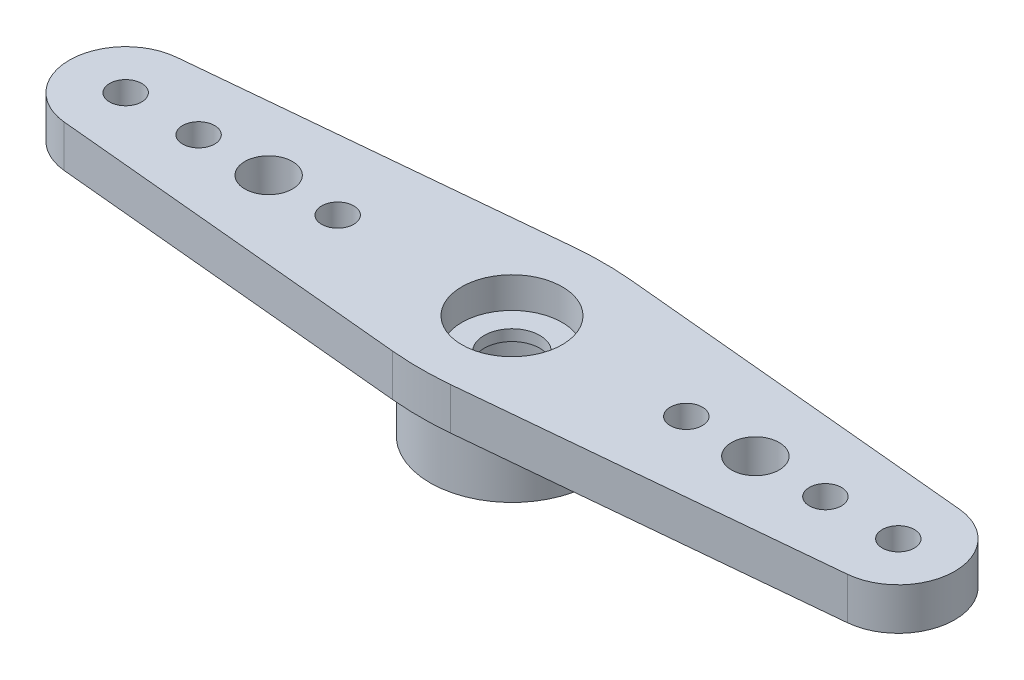
ISO-10303-21;
HEADER;
FILE_DESCRIPTION(('STEP AP214'),'2;1');
FILE_NAME('part.step','',(''),(''),'','','');
FILE_SCHEMA(('AUTOMOTIVE_DESIGN { 1 0 10303 214 1 1 1 1 }'));
ENDSEC;
DATA;
#1=APPLICATION_CONTEXT('core data for automotive mechanical design processes');
#2=APPLICATION_PROTOCOL_DEFINITION('international standard','automotive_design',2000,#1);
#3=PRODUCT_CONTEXT('',#1,'mechanical');
#4=PRODUCT('Part','Part','',(#3));
#5=PRODUCT_RELATED_PRODUCT_CATEGORY('part','',(#4));
#6=PRODUCT_DEFINITION_FORMATION('','',#4);
#7=PRODUCT_DEFINITION_CONTEXT('part definition',#1,'design');
#8=PRODUCT_DEFINITION('design','',#6,#7);
#9=PRODUCT_DEFINITION_SHAPE('','',#8);
#10=(LENGTH_UNIT() NAMED_UNIT(*) SI_UNIT(.MILLI.,.METRE.));
#11=(NAMED_UNIT(*) PLANE_ANGLE_UNIT() SI_UNIT($,.RADIAN.));
#12=(NAMED_UNIT(*) SI_UNIT($,.STERADIAN.) SOLID_ANGLE_UNIT());
#13=UNCERTAINTY_MEASURE_WITH_UNIT(LENGTH_MEASURE(1.E-05),#10,'distance_accuracy_value','');
#14=(GEOMETRIC_REPRESENTATION_CONTEXT(3) GLOBAL_UNCERTAINTY_ASSIGNED_CONTEXT((#13)) GLOBAL_UNIT_ASSIGNED_CONTEXT((#10,
#11,#12)) REPRESENTATION_CONTEXT('',''));
#15=CARTESIAN_POINT('',(0.,0.,0.));
#16=DIRECTION('',(0.,0.,1.));
#17=DIRECTION('',(1.,0.,0.));
#18=AXIS2_PLACEMENT_3D('',#15,#16,#17);
#19=CARTESIAN_POINT('',(0.,4.2672,0.));
#20=DIRECTION('',(0.,-1.,0.));
#21=DIRECTION('',(0.,0.,-1.));
#22=AXIS2_PLACEMENT_3D('',#19,#20,#21);
#23=CYLINDRICAL_SURFACE('',#22,1.143);
#24=CARTESIAN_POINT('',(0.,2.54,0.));
#25=DIRECTION('',(0.,1.,0.));
#26=DIRECTION('',(0.,0.,1.));
#27=AXIS2_PLACEMENT_3D('',#24,#25,#26);
#28=CIRCLE('',#27,1.143);
#29=CARTESIAN_POINT('',(0.,2.54,1.143));
#30=VERTEX_POINT('',#29);
#31=EDGE_CURVE('E117',#30,#30,#28,.T.);
#32=ORIENTED_EDGE('',*,*,#31,.F.);
#33=EDGE_LOOP('',(#32));
#34=FACE_BOUND('',#33,.T.);
#35=CARTESIAN_POINT('',(0.,2.9972,0.));
#36=DIRECTION('',(0.,1.,0.));
#37=DIRECTION('',(0.,0.,1.));
#38=AXIS2_PLACEMENT_3D('',#35,#36,#37);
#39=CIRCLE('',#38,1.143);
#40=CARTESIAN_POINT('',(0.,2.9972,1.143));
#41=VERTEX_POINT('',#40);
#42=EDGE_CURVE('E405',#41,#41,#39,.F.);
#43=ORIENTED_EDGE('',*,*,#42,.F.);
#44=EDGE_LOOP('',(#43));
#45=FACE_BOUND('',#44,.T.);
#46=ADVANCED_FACE('F40',(#34,#45),#23,.F.);
#47=CARTESIAN_POINT('',(0.,0.,0.));
#48=DIRECTION('',(0.,1.,0.));
#49=DIRECTION('',(0.,0.,1.));
#50=AXIS2_PLACEMENT_3D('',#47,#48,#49);
#51=PLANE('',#50);
#52=CARTESIAN_POINT('',(0.,0.,0.));
#53=DIRECTION('',(0.,1.,0.));
#54=DIRECTION('',(0.,0.,1.));
#55=AXIS2_PLACEMENT_3D('',#52,#53,#54);
#56=CIRCLE('',#55,3.3655);
#57=CARTESIAN_POINT('',(0.,0.,3.3655));
#58=VERTEX_POINT('',#57);
#59=EDGE_CURVE('E238',#58,#58,#56,.T.);
#60=ORIENTED_EDGE('',*,*,#59,.F.);
#61=EDGE_LOOP('',(#60));
#62=FACE_BOUND('',#61,.T.);
#63=CARTESIAN_POINT('',(0.,0.,0.));
#64=DIRECTION('',(0.,1.,0.));
#65=DIRECTION('',(0.,0.,1.));
#66=AXIS2_PLACEMENT_3D('',#63,#64,#65);
#67=CIRCLE('',#66,2.2352);
#68=CARTESIAN_POINT('',(0.,0.,2.2352));
#69=VERTEX_POINT('',#68);
#70=EDGE_CURVE('E234',#69,#69,#67,.T.);
#71=ORIENTED_EDGE('',*,*,#70,.T.);
#72=EDGE_LOOP('',(#71));
#73=FACE_BOUND('',#72,.T.);
#74=ADVANCED_FACE('F294',(#62,#73),#51,.F.);
#75=CARTESIAN_POINT('',(0.,2.54,0.));
#76=DIRECTION('',(0.,-1.,0.));
#77=DIRECTION('',(0.,0.,-1.));
#78=AXIS2_PLACEMENT_3D('',#75,#76,#77);
#79=CYLINDRICAL_SURFACE('',#78,3.3655);
#80=CARTESIAN_POINT('',(0.,2.54,0.));
#81=DIRECTION('',(0.,1.,0.));
#82=DIRECTION('',(0.,0.,1.));
#83=AXIS2_PLACEMENT_3D('',#80,#81,#82);
#84=CIRCLE('',#83,3.3655);
#85=CARTESIAN_POINT('',(0.,2.54,3.3655));
#86=VERTEX_POINT('',#85);
#87=EDGE_CURVE('E239',#86,#86,#84,.T.);
#88=ORIENTED_EDGE('',*,*,#87,.F.);
#89=EDGE_LOOP('',(#88));
#90=FACE_BOUND('',#89,.T.);
#91=ORIENTED_EDGE('',*,*,#59,.T.);
#92=EDGE_LOOP('',(#91));
#93=FACE_BOUND('',#92,.T.);
#94=ADVANCED_FACE('F300',(#90,#93),#79,.T.);
#95=CARTESIAN_POINT('',(0.,2.54,0.));
#96=DIRECTION('',(0.,-1.,0.));
#97=DIRECTION('',(0.,0.,-1.));
#98=AXIS2_PLACEMENT_3D('',#95,#96,#97);
#99=CYLINDRICAL_SURFACE('',#98,2.2352);
#100=CARTESIAN_POINT('',(0.,2.54,0.));
#101=DIRECTION('',(0.,1.,0.));
#102=DIRECTION('',(0.,0.,1.));
#103=AXIS2_PLACEMENT_3D('',#100,#101,#102);
#104=CIRCLE('',#103,2.2352);
#105=CARTESIAN_POINT('',(0.,2.54,2.2352));
#106=VERTEX_POINT('',#105);
#107=EDGE_CURVE('E128',#106,#106,#104,.T.);
#108=ORIENTED_EDGE('',*,*,#107,.T.);
#109=EDGE_LOOP('',(#108));
#110=FACE_BOUND('',#109,.T.);
#111=ORIENTED_EDGE('',*,*,#70,.F.);
#112=EDGE_LOOP('',(#111));
#113=FACE_BOUND('',#112,.T.);
#114=ADVANCED_FACE('F345',(#110,#113),#99,.F.);
#115=CARTESIAN_POINT('',(-29.0607200096115,2.54,0.));
#116=DIRECTION('',(0.,1.,0.));
#117=DIRECTION('',(0.,0.,1.));
#118=AXIS2_PLACEMENT_3D('',#115,#116,#117);
#119=PLANE('',#118);
#120=CARTESIAN_POINT('',(10.,2.54,0.));
#121=DIRECTION('',(0.,1.,0.));
#122=DIRECTION('',(0.,0.,1.));
#123=AXIS2_PLACEMENT_3D('',#120,#121,#122);
#124=CIRCLE('',#123,0.98);
#125=CARTESIAN_POINT('',(10.,2.54,0.98));
#126=VERTEX_POINT('',#125);
#127=EDGE_CURVE('E397',#126,#126,#124,.T.);
#128=ORIENTED_EDGE('',*,*,#127,.T.);
#129=EDGE_LOOP('',(#128));
#130=FACE_BOUND('',#129,.T.);
#131=CARTESIAN_POINT('',(-10.,2.54,0.));
#132=DIRECTION('',(0.,1.,0.));
#133=DIRECTION('',(0.,0.,1.));
#134=AXIS2_PLACEMENT_3D('',#131,#132,#133);
#135=CIRCLE('',#134,0.98);
#136=CARTESIAN_POINT('',(-10.,2.54,0.98));
#137=VERTEX_POINT('',#136);
#138=EDGE_CURVE('E400',#137,#137,#135,.T.);
#139=ORIENTED_EDGE('',*,*,#138,.T.);
#140=EDGE_LOOP('',(#139));
#141=FACE_BOUND('',#140,.T.);
#142=DIRECTION('',(-0.995596740434201,0.,0.0937396950965555));
#143=VECTOR('',#142,1.);
#144=CARTESIAN_POINT('',(-29.162120546294,2.54,-1.07696151236052));
#145=LINE('',#144,#143);
#146=CARTESIAN_POINT('',(-1.19049412772623,2.54,-3.71060988156648));
#147=VERTEX_POINT('',#146);
#148=CARTESIAN_POINT('',(-16.09226517831,2.54,-2.30754434514137));
#149=VERTEX_POINT('',#148);
#150=EDGE_CURVE('E123',#147,#149,#145,.T.);
#151=ORIENTED_EDGE('',*,*,#150,.F.);
#152=CARTESIAN_POINT('',(0.,2.54,8.93346872194787));
#153=DIRECTION('',(0.,1.,0.));
#154=DIRECTION('',(0.,0.,1.));
#155=AXIS2_PLACEMENT_3D('',#152,#153,#154);
#156=CIRCLE('',#155,12.7);
#157=CARTESIAN_POINT('',(1.19049412772628,2.54,-3.71060988156648));
#158=VERTEX_POINT('',#157);
#159=EDGE_CURVE('E252',#147,#158,#156,.F.);
#160=ORIENTED_EDGE('',*,*,#159,.T.);
#161=DIRECTION('',(0.995596740434201,0.,0.0937396950965555));
#162=VECTOR('',#161,1.);
#163=CARTESIAN_POINT('',(-28.4485987983057,2.54,-6.50125736059801));
#164=LINE('',#163,#162);
#165=CARTESIAN_POINT('',(16.09226517831,2.54,-2.30754434514137));
#166=VERTEX_POINT('',#165);
#167=EDGE_CURVE('E192',#158,#166,#164,.T.);
#168=ORIENTED_EDGE('',*,*,#167,.T.);
#169=CARTESIAN_POINT('',(15.875,2.54,0.));
#170=DIRECTION('',(0.,1.,0.));
#171=DIRECTION('',(0.,0.,1.));
#172=AXIS2_PLACEMENT_3D('',#169,#170,#171);
#173=CIRCLE('',#172,2.31775);
#174=CARTESIAN_POINT('',(16.09226517831,2.54,2.30754434514137));
#175=VERTEX_POINT('',#174);
#176=EDGE_CURVE('E188',#175,#166,#173,.T.);
#177=ORIENTED_EDGE('',*,*,#176,.F.);
#178=DIRECTION('',(0.995596740434201,0.,-0.0937396950965555));
#179=VECTOR('',#178,1.);
#180=CARTESIAN_POINT('',(-28.4485987983057,2.54,6.50125736059801));
#181=LINE('',#180,#179);
#182=CARTESIAN_POINT('',(1.19049412772627,2.54,3.71060988156648));
#183=VERTEX_POINT('',#182);
#184=EDGE_CURVE('E185',#183,#175,#181,.T.);
#185=ORIENTED_EDGE('',*,*,#184,.F.);
#186=CARTESIAN_POINT('',(0.,2.54,-8.93346872194787));
#187=DIRECTION('',(0.,1.,0.));
#188=DIRECTION('',(0.,0.,1.));
#189=AXIS2_PLACEMENT_3D('',#186,#187,#188);
#190=CIRCLE('',#189,12.7);
#191=CARTESIAN_POINT('',(-1.19049412772624,2.54,3.71060988156648));
#192=VERTEX_POINT('',#191);
#193=EDGE_CURVE('E249',#183,#192,#190,.F.);
#194=ORIENTED_EDGE('',*,*,#193,.T.);
#195=DIRECTION('',(-0.995596740434201,0.,-0.0937396950965555));
#196=VECTOR('',#195,1.);
#197=CARTESIAN_POINT('',(-29.162120546294,2.54,1.07696151236052));
#198=LINE('',#197,#196);
#199=CARTESIAN_POINT('',(-16.09226517831,2.54,2.30754434514137));
#200=VERTEX_POINT('',#199);
#201=EDGE_CURVE('E182',#192,#200,#198,.T.);
#202=ORIENTED_EDGE('',*,*,#201,.T.);
#203=CARTESIAN_POINT('',(-15.875,2.54,0.));
#204=DIRECTION('',(0.,1.,0.));
#205=DIRECTION('',(0.,0.,1.));
#206=AXIS2_PLACEMENT_3D('',#203,#204,#205);
#207=CIRCLE('',#206,2.31775);
#208=EDGE_CURVE('E178',#200,#149,#207,.F.);
#209=ORIENTED_EDGE('',*,*,#208,.T.);
#210=EDGE_LOOP('',(#151,#160,#168,#177,#185,#194,#202,#209));
#211=FACE_BOUND('',#210,.T.);
#212=CARTESIAN_POINT('',(-7.1628,2.54,0.));
#213=DIRECTION('',(0.,1.,0.));
#214=DIRECTION('',(0.,0.,1.));
#215=AXIS2_PLACEMENT_3D('',#212,#213,#214);
#216=CIRCLE('',#215,0.6604);
#217=CARTESIAN_POINT('',(-7.1628,2.54,0.6604));
#218=VERTEX_POINT('',#217);
#219=EDGE_CURVE('E195',#218,#218,#216,.F.);
#220=ORIENTED_EDGE('',*,*,#219,.F.);
#221=EDGE_LOOP('',(#220));
#222=FACE_BOUND('',#221,.T.);
#223=CARTESIAN_POINT('',(-12.8778,2.54,0.));
#224=DIRECTION('',(0.,1.,0.));
#225=DIRECTION('',(0.,0.,1.));
#226=AXIS2_PLACEMENT_3D('',#223,#224,#225);
#227=CIRCLE('',#226,0.660399999999998);
#228=CARTESIAN_POINT('',(-12.8778,2.54,0.660399999999998));
#229=VERTEX_POINT('',#228);
#230=EDGE_CURVE('E199',#229,#229,#227,.F.);
#231=ORIENTED_EDGE('',*,*,#230,.F.);
#232=EDGE_LOOP('',(#231));
#233=FACE_BOUND('',#232,.T.);
#234=CARTESIAN_POINT('',(-15.875,2.54,0.));
#235=DIRECTION('',(0.,1.,0.));
#236=DIRECTION('',(0.,0.,1.));
#237=AXIS2_PLACEMENT_3D('',#234,#235,#236);
#238=CIRCLE('',#237,0.660399999999998);
#239=CARTESIAN_POINT('',(-15.875,2.54,0.660399999999998));
#240=VERTEX_POINT('',#239);
#241=EDGE_CURVE('E203',#240,#240,#238,.F.);
#242=ORIENTED_EDGE('',*,*,#241,.F.);
#243=EDGE_LOOP('',(#242));
#244=FACE_BOUND('',#243,.T.);
#245=CARTESIAN_POINT('',(12.8778,2.54,0.));
#246=DIRECTION('',(0.,1.,0.));
#247=DIRECTION('',(0.,0.,1.));
#248=AXIS2_PLACEMENT_3D('',#245,#246,#247);
#249=CIRCLE('',#248,0.660399999999998);
#250=CARTESIAN_POINT('',(12.8778,2.54,0.660399999999998));
#251=VERTEX_POINT('',#250);
#252=EDGE_CURVE('E207',#251,#251,#249,.T.);
#253=ORIENTED_EDGE('',*,*,#252,.T.);
#254=EDGE_LOOP('',(#253));
#255=FACE_BOUND('',#254,.T.);
#256=CARTESIAN_POINT('',(7.1628,2.54,0.));
#257=DIRECTION('',(0.,1.,0.));
#258=DIRECTION('',(0.,0.,1.));
#259=AXIS2_PLACEMENT_3D('',#256,#257,#258);
#260=CIRCLE('',#259,0.6604);
#261=CARTESIAN_POINT('',(7.1628,2.54,0.6604));
#262=VERTEX_POINT('',#261);
#263=EDGE_CURVE('E211',#262,#262,#260,.T.);
#264=ORIENTED_EDGE('',*,*,#263,.T.);
#265=EDGE_LOOP('',(#264));
#266=FACE_BOUND('',#265,.T.);
#267=CARTESIAN_POINT('',(15.875,2.54,0.));
#268=DIRECTION('',(0.,1.,0.));
#269=DIRECTION('',(0.,0.,1.));
#270=AXIS2_PLACEMENT_3D('',#267,#268,#269);
#271=CIRCLE('',#270,0.660399999999998);
#272=CARTESIAN_POINT('',(15.875,2.54,0.660399999999998));
#273=VERTEX_POINT('',#272);
#274=EDGE_CURVE('E215',#273,#273,#271,.T.);
#275=ORIENTED_EDGE('',*,*,#274,.T.);
#276=EDGE_LOOP('',(#275));
#277=FACE_BOUND('',#276,.T.);
#278=ORIENTED_EDGE('',*,*,#87,.T.);
#279=EDGE_LOOP('',(#278));
#280=FACE_BOUND('',#279,.T.);
#281=ADVANCED_FACE('F271',(#130,#141,#211,#222,#233,#244,#255,#266,#277,#280),#119,.F.);
#282=CARTESIAN_POINT('',(-29.162120546294,4.2672,-1.07696151236052));
#283=DIRECTION('',(0.0937396950965555,0.,0.995596740434201));
#284=DIRECTION('',(0.995596740434201,0.,-0.0937396950965555));
#285=AXIS2_PLACEMENT_3D('',#282,#283,#284);
#286=PLANE('',#285);
#287=DIRECTION('',(-0.995596740434201,0.,0.0937396950965555));
#288=VECTOR('',#287,1.);
#289=CARTESIAN_POINT('',(-29.162120546294,4.2672,-1.07696151236052));
#290=LINE('',#289,#288);
#291=CARTESIAN_POINT('',(-1.19049412772623,4.2672,-3.71060988156648));
#292=VERTEX_POINT('',#291);
#293=CARTESIAN_POINT('',(-16.09226517831,4.2672,-2.30754434514137));
#294=VERTEX_POINT('',#293);
#295=EDGE_CURVE('E104',#292,#294,#290,.T.);
#296=ORIENTED_EDGE('',*,*,#295,.F.);
#297=DIRECTION('',(0.,-1.,0.));
#298=VECTOR('',#297,1.);
#299=CARTESIAN_POINT('',(-1.19049412772624,2.54,-3.71060988156648));
#300=LINE('',#299,#298);
#301=EDGE_CURVE('E243',#292,#147,#300,.T.);
#302=ORIENTED_EDGE('',*,*,#301,.T.);
#303=ORIENTED_EDGE('',*,*,#150,.T.);
#304=DIRECTION('',(0.,-1.,0.));
#305=VECTOR('',#304,1.);
#306=CARTESIAN_POINT('',(-16.09226517831,4.2672,-2.30754434514137));
#307=LINE('',#306,#305);
#308=EDGE_CURVE('E120',#294,#149,#307,.T.);
#309=ORIENTED_EDGE('',*,*,#308,.F.);
#310=EDGE_LOOP('',(#296,#302,#303,#309));
#311=FACE_BOUND('',#310,.T.);
#312=ADVANCED_FACE('F121',(#311),#286,.F.);
#313=CARTESIAN_POINT('',(-15.875,4.2672,0.));
#314=DIRECTION('',(0.,-1.,0.));
#315=DIRECTION('',(0.,0.,-1.));
#316=AXIS2_PLACEMENT_3D('',#313,#314,#315);
#317=CYLINDRICAL_SURFACE('',#316,2.31775);
#318=ORIENTED_EDGE('',*,*,#208,.F.);
#319=DIRECTION('',(0.,-1.,0.));
#320=VECTOR('',#319,1.);
#321=CARTESIAN_POINT('',(-16.09226517831,4.2672,2.30754434514137));
#322=LINE('',#321,#320);
#323=CARTESIAN_POINT('',(-16.09226517831,4.2672,2.30754434514137));
#324=VERTEX_POINT('',#323);
#325=EDGE_CURVE('E129',#324,#200,#322,.T.);
#326=ORIENTED_EDGE('',*,*,#325,.F.);
#327=CARTESIAN_POINT('',(-15.875,4.2672,0.));
#328=DIRECTION('',(0.,1.,0.));
#329=DIRECTION('',(0.,0.,1.));
#330=AXIS2_PLACEMENT_3D('',#327,#328,#329);
#331=CIRCLE('',#330,2.31775);
#332=EDGE_CURVE('E110',#324,#294,#331,.F.);
#333=ORIENTED_EDGE('',*,*,#332,.T.);
#334=ORIENTED_EDGE('',*,*,#308,.T.);
#335=EDGE_LOOP('',(#318,#326,#333,#334));
#336=FACE_BOUND('',#335,.T.);
#337=ADVANCED_FACE('F132',(#336),#317,.T.);
#338=CARTESIAN_POINT('',(-29.162120546294,4.2672,1.07696151236052));
#339=DIRECTION('',(-0.0937396950965555,0.,0.995596740434201));
#340=DIRECTION('',(0.995596740434201,0.,0.0937396950965555));
#341=AXIS2_PLACEMENT_3D('',#338,#339,#340);
#342=PLANE('',#341);
#343=ORIENTED_EDGE('',*,*,#201,.F.);
#344=DIRECTION('',(0.,-1.,0.));
#345=VECTOR('',#344,1.);
#346=CARTESIAN_POINT('',(-1.19049412772625,4.2672,3.71060988156648));
#347=LINE('',#346,#345);
#348=CARTESIAN_POINT('',(-1.19049412772624,4.2672,3.71060988156648));
#349=VERTEX_POINT('',#348);
#350=EDGE_CURVE('E11',#192,#349,#347,.F.);
#351=ORIENTED_EDGE('',*,*,#350,.T.);
#352=DIRECTION('',(-0.995596740434201,0.,-0.0937396950965555));
#353=VECTOR('',#352,1.);
#354=CARTESIAN_POINT('',(-29.162120546294,4.2672,1.07696151236052));
#355=LINE('',#354,#353);
#356=EDGE_CURVE('E135',#349,#324,#355,.T.);
#357=ORIENTED_EDGE('',*,*,#356,.T.);
#358=ORIENTED_EDGE('',*,*,#325,.T.);
#359=EDGE_LOOP('',(#343,#351,#357,#358));
#360=FACE_BOUND('',#359,.T.);
#361=ADVANCED_FACE('F282',(#360),#342,.T.);
#362=CARTESIAN_POINT('',(-28.4485987983057,4.2672,6.50125736059801));
#363=DIRECTION('',(-0.0937396950965555,0.,-0.995596740434201));
#364=DIRECTION('',(-0.995596740434201,0.,0.0937396950965555));
#365=AXIS2_PLACEMENT_3D('',#362,#363,#364);
#366=PLANE('',#365);
#367=DIRECTION('',(0.995596740434201,0.,-0.0937396950965555));
#368=VECTOR('',#367,1.);
#369=CARTESIAN_POINT('',(-28.4485987983057,4.2672,6.50125736059801));
#370=LINE('',#369,#368);
#371=CARTESIAN_POINT('',(1.19049412772627,4.2672,3.71060988156648));
#372=VERTEX_POINT('',#371);
#373=CARTESIAN_POINT('',(16.09226517831,4.2672,2.30754434514137));
#374=VERTEX_POINT('',#373);
#375=EDGE_CURVE('E138',#372,#374,#370,.T.);
#376=ORIENTED_EDGE('',*,*,#375,.F.);
#377=DIRECTION('',(0.,-1.,0.));
#378=VECTOR('',#377,1.);
#379=CARTESIAN_POINT('',(1.19049412772626,2.54,3.71060988156648));
#380=LINE('',#379,#378);
#381=EDGE_CURVE('E49',#372,#183,#380,.T.);
#382=ORIENTED_EDGE('',*,*,#381,.T.);
#383=ORIENTED_EDGE('',*,*,#184,.T.);
#384=DIRECTION('',(0.,-1.,0.));
#385=VECTOR('',#384,1.);
#386=CARTESIAN_POINT('',(16.09226517831,4.2672,2.30754434514137));
#387=LINE('',#386,#385);
#388=EDGE_CURVE('E225',#374,#175,#387,.T.);
#389=ORIENTED_EDGE('',*,*,#388,.F.);
#390=EDGE_LOOP('',(#376,#382,#383,#389));
#391=FACE_BOUND('',#390,.T.);
#392=ADVANCED_FACE('F266',(#391),#366,.F.);
#393=CARTESIAN_POINT('',(15.875,4.2672,0.));
#394=DIRECTION('',(0.,-1.,0.));
#395=DIRECTION('',(0.,0.,-1.));
#396=AXIS2_PLACEMENT_3D('',#393,#394,#395);
#397=CYLINDRICAL_SURFACE('',#396,2.31775);
#398=ORIENTED_EDGE('',*,*,#176,.T.);
#399=DIRECTION('',(0.,-1.,0.));
#400=VECTOR('',#399,1.);
#401=CARTESIAN_POINT('',(16.09226517831,4.2672,-2.30754434514137));
#402=LINE('',#401,#400);
#403=CARTESIAN_POINT('',(16.09226517831,4.2672,-2.30754434514137));
#404=VERTEX_POINT('',#403);
#405=EDGE_CURVE('E175',#404,#166,#402,.T.);
#406=ORIENTED_EDGE('',*,*,#405,.F.);
#407=CARTESIAN_POINT('',(15.875,4.2672,0.));
#408=DIRECTION('',(0.,1.,0.));
#409=DIRECTION('',(0.,0.,1.));
#410=AXIS2_PLACEMENT_3D('',#407,#408,#409);
#411=CIRCLE('',#410,2.31775);
#412=EDGE_CURVE('E144',#374,#404,#411,.T.);
#413=ORIENTED_EDGE('',*,*,#412,.F.);
#414=ORIENTED_EDGE('',*,*,#388,.T.);
#415=EDGE_LOOP('',(#398,#406,#413,#414));
#416=FACE_BOUND('',#415,.T.);
#417=ADVANCED_FACE('F276',(#416),#397,.T.);
#418=CARTESIAN_POINT('',(15.875,4.2672,0.));
#419=DIRECTION('',(0.,-1.,0.));
#420=DIRECTION('',(0.,0.,-1.));
#421=AXIS2_PLACEMENT_3D('',#418,#419,#420);
#422=CYLINDRICAL_SURFACE('',#421,0.660399999999998);
#423=CARTESIAN_POINT('',(15.875,4.2672,0.));
#424=DIRECTION('',(0.,1.,0.));
#425=DIRECTION('',(0.,0.,1.));
#426=AXIS2_PLACEMENT_3D('',#423,#424,#425);
#427=CIRCLE('',#426,0.660399999999998);
#428=CARTESIAN_POINT('',(15.875,4.2672,0.660399999999998));
#429=VERTEX_POINT('',#428);
#430=EDGE_CURVE('E171',#429,#429,#427,.T.);
#431=ORIENTED_EDGE('',*,*,#430,.T.);
#432=EDGE_LOOP('',(#431));
#433=FACE_BOUND('',#432,.T.);
#434=ORIENTED_EDGE('',*,*,#274,.F.);
#435=EDGE_LOOP('',(#434));
#436=FACE_BOUND('',#435,.T.);
#437=ADVANCED_FACE('F308',(#433,#436),#422,.F.);
#438=CARTESIAN_POINT('',(7.1628,4.2672,0.));
#439=DIRECTION('',(0.,-1.,0.));
#440=DIRECTION('',(0.,0.,-1.));
#441=AXIS2_PLACEMENT_3D('',#438,#439,#440);
#442=CYLINDRICAL_SURFACE('',#441,0.6604);
#443=CARTESIAN_POINT('',(7.1628,4.2672,0.));
#444=DIRECTION('',(0.,1.,0.));
#445=DIRECTION('',(0.,0.,1.));
#446=AXIS2_PLACEMENT_3D('',#443,#444,#445);
#447=CIRCLE('',#446,0.6604);
#448=CARTESIAN_POINT('',(7.1628,4.2672,0.6604));
#449=VERTEX_POINT('',#448);
#450=EDGE_CURVE('E167',#449,#449,#447,.T.);
#451=ORIENTED_EDGE('',*,*,#450,.T.);
#452=EDGE_LOOP('',(#451));
#453=FACE_BOUND('',#452,.T.);
#454=ORIENTED_EDGE('',*,*,#263,.F.);
#455=EDGE_LOOP('',(#454));
#456=FACE_BOUND('',#455,.T.);
#457=ADVANCED_FACE('F311',(#453,#456),#442,.F.);
#458=CARTESIAN_POINT('',(12.8778,4.2672,0.));
#459=DIRECTION('',(0.,-1.,0.));
#460=DIRECTION('',(0.,0.,-1.));
#461=AXIS2_PLACEMENT_3D('',#458,#459,#460);
#462=CYLINDRICAL_SURFACE('',#461,0.660399999999998);
#463=CARTESIAN_POINT('',(12.8778,4.2672,0.));
#464=DIRECTION('',(0.,1.,0.));
#465=DIRECTION('',(0.,0.,1.));
#466=AXIS2_PLACEMENT_3D('',#463,#464,#465);
#467=CIRCLE('',#466,0.660399999999998);
#468=CARTESIAN_POINT('',(12.8778,4.2672,0.660399999999998));
#469=VERTEX_POINT('',#468);
#470=EDGE_CURVE('E163',#469,#469,#467,.T.);
#471=ORIENTED_EDGE('',*,*,#470,.T.);
#472=EDGE_LOOP('',(#471));
#473=FACE_BOUND('',#472,.T.);
#474=ORIENTED_EDGE('',*,*,#252,.F.);
#475=EDGE_LOOP('',(#474));
#476=FACE_BOUND('',#475,.T.);
#477=ADVANCED_FACE('F315',(#473,#476),#462,.F.);
#478=CARTESIAN_POINT('',(-15.875,4.2672,0.));
#479=DIRECTION('',(0.,-1.,0.));
#480=DIRECTION('',(0.,0.,-1.));
#481=AXIS2_PLACEMENT_3D('',#478,#479,#480);
#482=CYLINDRICAL_SURFACE('',#481,0.660399999999998);
#483=CARTESIAN_POINT('',(-15.875,4.2672,0.));
#484=DIRECTION('',(0.,1.,0.));
#485=DIRECTION('',(0.,0.,1.));
#486=AXIS2_PLACEMENT_3D('',#483,#484,#485);
#487=CIRCLE('',#486,0.660399999999998);
#488=CARTESIAN_POINT('',(-15.875,4.2672,0.660399999999998));
#489=VERTEX_POINT('',#488);
#490=EDGE_CURVE('E159',#489,#489,#487,.F.);
#491=ORIENTED_EDGE('',*,*,#490,.F.);
#492=EDGE_LOOP('',(#491));
#493=FACE_BOUND('',#492,.T.);
#494=ORIENTED_EDGE('',*,*,#241,.T.);
#495=EDGE_LOOP('',(#494));
#496=FACE_BOUND('',#495,.T.);
#497=ADVANCED_FACE('F319',(#493,#496),#482,.F.);
#498=CARTESIAN_POINT('',(-12.8778,4.2672,0.));
#499=DIRECTION('',(0.,-1.,0.));
#500=DIRECTION('',(0.,0.,-1.));
#501=AXIS2_PLACEMENT_3D('',#498,#499,#500);
#502=CYLINDRICAL_SURFACE('',#501,0.660399999999998);
#503=CARTESIAN_POINT('',(-12.8778,4.2672,0.));
#504=DIRECTION('',(0.,1.,0.));
#505=DIRECTION('',(0.,0.,1.));
#506=AXIS2_PLACEMENT_3D('',#503,#504,#505);
#507=CIRCLE('',#506,0.660399999999998);
#508=CARTESIAN_POINT('',(-12.8778,4.2672,0.660399999999998));
#509=VERTEX_POINT('',#508);
#510=EDGE_CURVE('E155',#509,#509,#507,.F.);
#511=ORIENTED_EDGE('',*,*,#510,.F.);
#512=EDGE_LOOP('',(#511));
#513=FACE_BOUND('',#512,.T.);
#514=ORIENTED_EDGE('',*,*,#230,.T.);
#515=EDGE_LOOP('',(#514));
#516=FACE_BOUND('',#515,.T.);
#517=ADVANCED_FACE('F323',(#513,#516),#502,.F.);
#518=CARTESIAN_POINT('',(-7.1628,4.2672,0.));
#519=DIRECTION('',(0.,-1.,0.));
#520=DIRECTION('',(0.,0.,-1.));
#521=AXIS2_PLACEMENT_3D('',#518,#519,#520);
#522=CYLINDRICAL_SURFACE('',#521,0.6604);
#523=CARTESIAN_POINT('',(-7.1628,4.2672,0.));
#524=DIRECTION('',(0.,1.,0.));
#525=DIRECTION('',(0.,0.,1.));
#526=AXIS2_PLACEMENT_3D('',#523,#524,#525);
#527=CIRCLE('',#526,0.6604);
#528=CARTESIAN_POINT('',(-7.1628,4.2672,0.6604));
#529=VERTEX_POINT('',#528);
#530=EDGE_CURVE('E151',#529,#529,#527,.F.);
#531=ORIENTED_EDGE('',*,*,#530,.F.);
#532=EDGE_LOOP('',(#531));
#533=FACE_BOUND('',#532,.T.);
#534=ORIENTED_EDGE('',*,*,#219,.T.);
#535=EDGE_LOOP('',(#534));
#536=FACE_BOUND('',#535,.T.);
#537=ADVANCED_FACE('F327',(#533,#536),#522,.F.);
#538=CARTESIAN_POINT('',(-28.4485987983057,4.2672,-6.50125736059801));
#539=DIRECTION('',(0.0937396950965555,0.,-0.995596740434201));
#540=DIRECTION('',(-0.995596740434201,0.,-0.0937396950965555));
#541=AXIS2_PLACEMENT_3D('',#538,#539,#540);
#542=PLANE('',#541);
#543=ORIENTED_EDGE('',*,*,#167,.F.);
#544=DIRECTION('',(0.,-1.,0.));
#545=VECTOR('',#544,1.);
#546=CARTESIAN_POINT('',(1.19049412772627,4.2672,-3.71060988156648));
#547=LINE('',#546,#545);
#548=CARTESIAN_POINT('',(1.19049412772628,4.2672,-3.71060988156648));
#549=VERTEX_POINT('',#548);
#550=EDGE_CURVE('E255',#158,#549,#547,.F.);
#551=ORIENTED_EDGE('',*,*,#550,.T.);
#552=DIRECTION('',(0.995596740434201,0.,0.0937396950965555));
#553=VECTOR('',#552,1.);
#554=CARTESIAN_POINT('',(-28.4485987983057,4.2672,-6.50125736059801));
#555=LINE('',#554,#553);
#556=EDGE_CURVE('E148',#549,#404,#555,.T.);
#557=ORIENTED_EDGE('',*,*,#556,.T.);
#558=ORIENTED_EDGE('',*,*,#405,.T.);
#559=EDGE_LOOP('',(#543,#551,#557,#558));
#560=FACE_BOUND('',#559,.T.);
#561=ADVANCED_FACE('F331',(#560),#542,.T.);
#562=CARTESIAN_POINT('',(-29.0607200096115,4.2672,0.));
#563=DIRECTION('',(0.,1.,0.));
#564=DIRECTION('',(0.,0.,1.));
#565=AXIS2_PLACEMENT_3D('',#562,#563,#564);
#566=PLANE('',#565);
#567=CARTESIAN_POINT('',(10.,4.2672,0.));
#568=DIRECTION('',(0.,1.,0.));
#569=DIRECTION('',(0.,0.,1.));
#570=AXIS2_PLACEMENT_3D('',#567,#568,#569);
#571=CIRCLE('',#570,0.98);
#572=CARTESIAN_POINT('',(10.,4.2672,0.98));
#573=VERTEX_POINT('',#572);
#574=EDGE_CURVE('E395',#573,#573,#571,.T.);
#575=ORIENTED_EDGE('',*,*,#574,.F.);
#576=EDGE_LOOP('',(#575));
#577=FACE_BOUND('',#576,.T.);
#578=CARTESIAN_POINT('',(-10.,4.2672,0.));
#579=DIRECTION('',(0.,1.,0.));
#580=DIRECTION('',(0.,0.,-1.));
#581=AXIS2_PLACEMENT_3D('',#578,#579,#580);
#582=CIRCLE('',#581,0.98);
#583=CARTESIAN_POINT('',(-10.,4.2672,-0.98));
#584=VERTEX_POINT('',#583);
#585=EDGE_CURVE('E421',#584,#584,#582,.T.);
#586=ORIENTED_EDGE('',*,*,#585,.F.);
#587=EDGE_LOOP('',(#586));
#588=FACE_BOUND('',#587,.T.);
#589=CARTESIAN_POINT('',(0.,4.2672,0.));
#590=DIRECTION('',(0.,1.,0.));
#591=DIRECTION('',(0.,0.,1.));
#592=AXIS2_PLACEMENT_3D('',#589,#590,#591);
#593=CIRCLE('',#592,2.06375);
#594=CARTESIAN_POINT('',(0.,4.2672,2.06375));
#595=VERTEX_POINT('',#594);
#596=EDGE_CURVE('E399',#595,#595,#593,.T.);
#597=ORIENTED_EDGE('',*,*,#596,.F.);
#598=EDGE_LOOP('',(#597));
#599=FACE_BOUND('',#598,.T.);
#600=ORIENTED_EDGE('',*,*,#556,.F.);
#601=CARTESIAN_POINT('',(0.,4.2672,8.93346872194787));
#602=DIRECTION('',(0.,1.,0.));
#603=DIRECTION('',(0.,0.,1.));
#604=AXIS2_PLACEMENT_3D('',#601,#602,#603);
#605=CIRCLE('',#604,12.7);
#606=EDGE_CURVE('E112',#549,#292,#605,.T.);
#607=ORIENTED_EDGE('',*,*,#606,.T.);
#608=ORIENTED_EDGE('',*,*,#295,.T.);
#609=ORIENTED_EDGE('',*,*,#332,.F.);
#610=ORIENTED_EDGE('',*,*,#356,.F.);
#611=CARTESIAN_POINT('',(0.,4.2672,-8.93346872194787));
#612=DIRECTION('',(0.,1.,0.));
#613=DIRECTION('',(0.,0.,1.));
#614=AXIS2_PLACEMENT_3D('',#611,#612,#613);
#615=CIRCLE('',#614,12.7);
#616=EDGE_CURVE('E56',#349,#372,#615,.T.);
#617=ORIENTED_EDGE('',*,*,#616,.T.);
#618=ORIENTED_EDGE('',*,*,#375,.T.);
#619=ORIENTED_EDGE('',*,*,#412,.T.);
#620=EDGE_LOOP('',(#600,#607,#608,#609,#610,#617,#618,#619));
#621=FACE_BOUND('',#620,.T.);
#622=ORIENTED_EDGE('',*,*,#530,.T.);
#623=EDGE_LOOP('',(#622));
#624=FACE_BOUND('',#623,.T.);
#625=ORIENTED_EDGE('',*,*,#510,.T.);
#626=EDGE_LOOP('',(#625));
#627=FACE_BOUND('',#626,.T.);
#628=ORIENTED_EDGE('',*,*,#490,.T.);
#629=EDGE_LOOP('',(#628));
#630=FACE_BOUND('',#629,.T.);
#631=ORIENTED_EDGE('',*,*,#470,.F.);
#632=EDGE_LOOP('',(#631));
#633=FACE_BOUND('',#632,.T.);
#634=ORIENTED_EDGE('',*,*,#450,.F.);
#635=EDGE_LOOP('',(#634));
#636=FACE_BOUND('',#635,.T.);
#637=ORIENTED_EDGE('',*,*,#430,.F.);
#638=EDGE_LOOP('',(#637));
#639=FACE_BOUND('',#638,.T.);
#640=ADVANCED_FACE('F107',(#577,#588,#599,#621,#624,#627,#630,#633,#636,#639),#566,.T.);
#641=ORIENTED_EDGE('',*,*,#107,.F.);
#642=EDGE_LOOP('',(#641));
#643=FACE_BOUND('',#642,.T.);
#644=ORIENTED_EDGE('',*,*,#31,.T.);
#645=EDGE_LOOP('',(#644));
#646=FACE_BOUND('',#645,.T.);
#647=ADVANCED_FACE('F292',(#643,#646),#119,.F.);
#648=CARTESIAN_POINT('',(0.,4.2672,8.93346872194787));
#649=DIRECTION('',(0.,1.,0.));
#650=DIRECTION('',(0.,0.,1.));
#651=AXIS2_PLACEMENT_3D('',#648,#649,#650);
#652=CYLINDRICAL_SURFACE('',#651,12.7);
#653=ORIENTED_EDGE('',*,*,#606,.F.);
#654=ORIENTED_EDGE('',*,*,#550,.F.);
#655=ORIENTED_EDGE('',*,*,#159,.F.);
#656=ORIENTED_EDGE('',*,*,#301,.F.);
#657=EDGE_LOOP('',(#653,#654,#655,#656));
#658=FACE_BOUND('',#657,.T.);
#659=ADVANCED_FACE('F281',(#658),#652,.T.);
#660=CARTESIAN_POINT('',(0.,4.2672,-8.93346872194787));
#661=DIRECTION('',(0.,1.,0.));
#662=DIRECTION('',(0.,0.,1.));
#663=AXIS2_PLACEMENT_3D('',#660,#661,#662);
#664=CYLINDRICAL_SURFACE('',#663,12.7);
#665=ORIENTED_EDGE('',*,*,#616,.F.);
#666=ORIENTED_EDGE('',*,*,#350,.F.);
#667=ORIENTED_EDGE('',*,*,#193,.F.);
#668=ORIENTED_EDGE('',*,*,#381,.F.);
#669=EDGE_LOOP('',(#665,#666,#667,#668));
#670=FACE_BOUND('',#669,.T.);
#671=ADVANCED_FACE('F42',(#670),#664,.T.);
#672=CARTESIAN_POINT('',(0.,2.9972,0.));
#673=DIRECTION('',(0.,1.,0.));
#674=DIRECTION('',(0.,0.,1.));
#675=AXIS2_PLACEMENT_3D('',#672,#673,#674);
#676=CYLINDRICAL_SURFACE('',#675,2.06375);
#677=CARTESIAN_POINT('',(0.,2.9972,0.));
#678=DIRECTION('',(0.,1.,0.));
#679=DIRECTION('',(0.,0.,1.));
#680=AXIS2_PLACEMENT_3D('',#677,#678,#679);
#681=CIRCLE('',#680,2.06375);
#682=CARTESIAN_POINT('',(0.,2.9972,2.06375));
#683=VERTEX_POINT('',#682);
#684=EDGE_CURVE('E179',#683,#683,#681,.T.);
#685=ORIENTED_EDGE('',*,*,#684,.F.);
#686=EDGE_LOOP('',(#685));
#687=FACE_BOUND('',#686,.T.);
#688=ORIENTED_EDGE('',*,*,#596,.T.);
#689=EDGE_LOOP('',(#688));
#690=FACE_BOUND('',#689,.T.);
#691=ADVANCED_FACE('F284',(#687,#690),#676,.F.);
#692=CARTESIAN_POINT('',(-28.8343368229583,2.9972,0.729493466455382));
#693=DIRECTION('',(0.,1.,0.));
#694=DIRECTION('',(0.,0.,1.));
#695=AXIS2_PLACEMENT_3D('',#692,#693,#694);
#696=PLANE('',#695);
#697=ORIENTED_EDGE('',*,*,#42,.T.);
#698=EDGE_LOOP('',(#697));
#699=FACE_BOUND('',#698,.T.);
#700=ORIENTED_EDGE('',*,*,#684,.T.);
#701=EDGE_LOOP('',(#700));
#702=FACE_BOUND('',#701,.T.);
#703=ADVANCED_FACE('F289',(#699,#702),#696,.T.);
#704=CARTESIAN_POINT('',(-10.,0.,0.));
#705=DIRECTION('',(0.,1.,0.));
#706=DIRECTION('',(0.,0.,1.));
#707=AXIS2_PLACEMENT_3D('',#704,#705,#706);
#708=CYLINDRICAL_SURFACE('',#707,0.98);
#709=ORIENTED_EDGE('',*,*,#585,.T.);
#710=EDGE_LOOP('',(#709));
#711=FACE_BOUND('',#710,.T.);
#712=ORIENTED_EDGE('',*,*,#138,.F.);
#713=EDGE_LOOP('',(#712));
#714=FACE_BOUND('',#713,.T.);
#715=ADVANCED_FACE('F383',(#711,#714),#708,.F.);
#716=CARTESIAN_POINT('',(10.,0.,0.));
#717=DIRECTION('',(0.,1.,0.));
#718=DIRECTION('',(0.,0.,1.));
#719=AXIS2_PLACEMENT_3D('',#716,#717,#718);
#720=CYLINDRICAL_SURFACE('',#719,0.98);
#721=ORIENTED_EDGE('',*,*,#574,.T.);
#722=EDGE_LOOP('',(#721));
#723=FACE_BOUND('',#722,.T.);
#724=ORIENTED_EDGE('',*,*,#127,.F.);
#725=EDGE_LOOP('',(#724));
#726=FACE_BOUND('',#725,.T.);
#727=ADVANCED_FACE('F387',(#723,#726),#720,.F.);
#728=CLOSED_SHELL('',(#46,#74,#94,#114,#281,#312,#337,#361,#392,#417,#437,#457,#477,#497,#517,
#537,#561,#640,#647,#659,#671,#691,#703,#715,#727));
#729=MANIFOLD_SOLID_BREP('B2',#728);
#730=ADVANCED_BREP_SHAPE_REPRESENTATION('',(#18,#729),#14);
#731=SHAPE_DEFINITION_REPRESENTATION(#9,#730);
ENDSEC;
END-ISO-10303-21;
